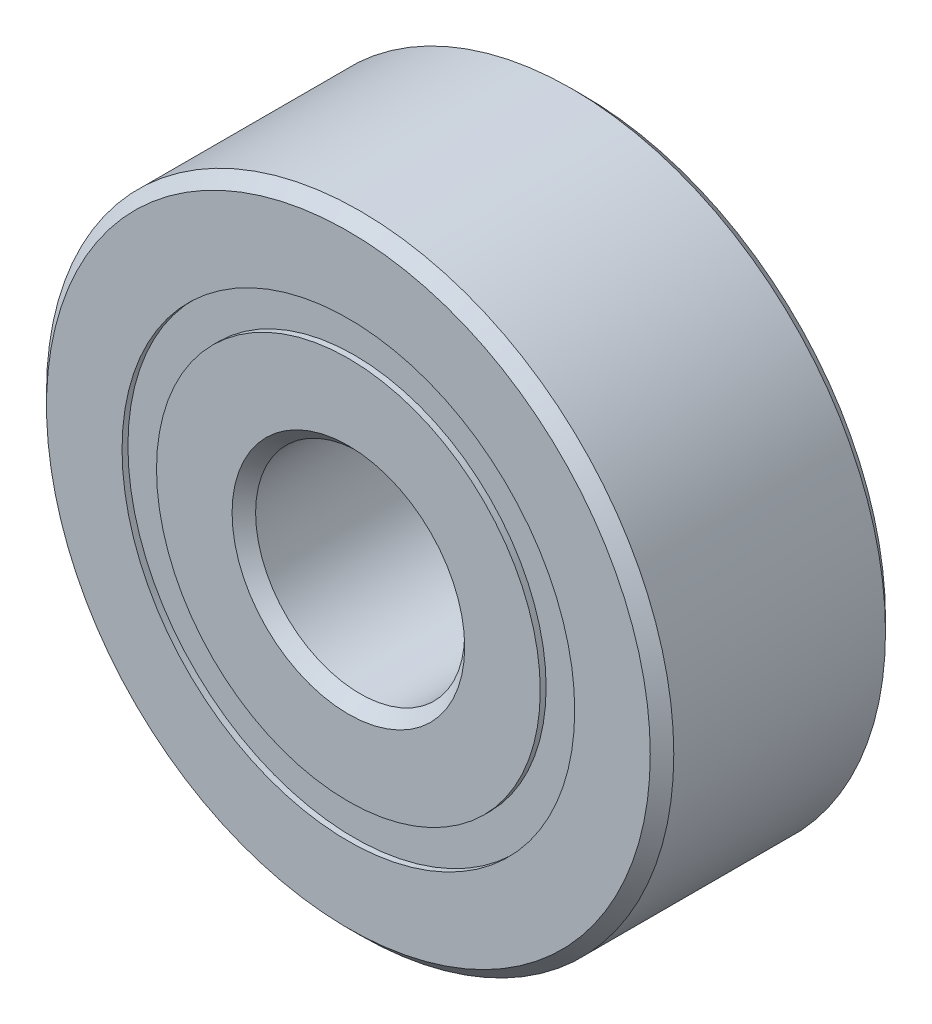
ISO-10303-21;
HEADER;
FILE_DESCRIPTION(('STEP AP214'),'2;1');
FILE_NAME('part.step','',(''),(''),'','','');
FILE_SCHEMA(('AUTOMOTIVE_DESIGN { 1 0 10303 214 1 1 1 1 }'));
ENDSEC;
DATA;
#1=APPLICATION_CONTEXT('core data for automotive mechanical design processes');
#2=APPLICATION_PROTOCOL_DEFINITION('international standard','automotive_design',2000,#1);
#3=PRODUCT_CONTEXT('',#1,'mechanical');
#4=PRODUCT('Part','Part','',(#3));
#5=PRODUCT_RELATED_PRODUCT_CATEGORY('part','',(#4));
#6=PRODUCT_DEFINITION_FORMATION('','',#4);
#7=PRODUCT_DEFINITION_CONTEXT('part definition',#1,'design');
#8=PRODUCT_DEFINITION('design','',#6,#7);
#9=PRODUCT_DEFINITION_SHAPE('','',#8);
#10=(LENGTH_UNIT() NAMED_UNIT(*) SI_UNIT(.MILLI.,.METRE.));
#11=(NAMED_UNIT(*) PLANE_ANGLE_UNIT() SI_UNIT($,.RADIAN.));
#12=(NAMED_UNIT(*) SI_UNIT($,.STERADIAN.) SOLID_ANGLE_UNIT());
#13=UNCERTAINTY_MEASURE_WITH_UNIT(LENGTH_MEASURE(1.E-05),#10,'distance_accuracy_value','');
#14=(GEOMETRIC_REPRESENTATION_CONTEXT(3) GLOBAL_UNCERTAINTY_ASSIGNED_CONTEXT((#13)) GLOBAL_UNIT_ASSIGNED_CONTEXT((#10,
#11,#12)) REPRESENTATION_CONTEXT('',''));
#15=CARTESIAN_POINT('',(0.,0.,0.));
#16=DIRECTION('',(0.,0.,1.));
#17=DIRECTION('',(1.,0.,0.));
#18=AXIS2_PLACEMENT_3D('',#15,#16,#17);
#19=CARTESIAN_POINT('',(0.,6.87335164835165,-3.39328125));
#20=DIRECTION('',(0.,0.,1.));
#21=DIRECTION('',(1.,0.,0.));
#22=AXIS2_PLACEMENT_3D('',#19,#20,#21);
#23=PLANE('',#22);
#24=CARTESIAN_POINT('',(0.,0.,-3.39328125));
#25=DIRECTION('',(0.,0.,1.));
#26=DIRECTION('',(1.,0.,0.));
#27=AXIS2_PLACEMENT_3D('',#24,#25,#26);
#28=CIRCLE('',#27,6.87335164835165);
#29=CARTESIAN_POINT('',(6.87335164835165,0.,-3.39328125));
#30=VERTEX_POINT('',#29);
#31=EDGE_CURVE('E55',#30,#30,#28,.T.);
#32=ORIENTED_EDGE('',*,*,#31,.F.);
#33=EDGE_LOOP('',(#32));
#34=FACE_BOUND('',#33,.T.);
#35=CARTESIAN_POINT('',(0.,0.,-3.39328125));
#36=DIRECTION('',(0.,0.,1.));
#37=DIRECTION('',(1.,0.,0.));
#38=AXIS2_PLACEMENT_3D('',#35,#36,#37);
#39=CIRCLE('',#38,5.82664835164835);
#40=CARTESIAN_POINT('',(5.82664835164835,0.,-3.39328125));
#41=VERTEX_POINT('',#40);
#42=EDGE_CURVE('E11',#41,#41,#39,.T.);
#43=ORIENTED_EDGE('',*,*,#42,.T.);
#44=EDGE_LOOP('',(#43));
#45=FACE_BOUND('',#44,.T.);
#46=ADVANCED_FACE('F41',(#34,#45),#23,.F.);
#47=CARTESIAN_POINT('',(0.,0.,3.571875));
#48=DIRECTION('',(0.,0.,1.));
#49=DIRECTION('',(1.,0.,0.));
#50=AXIS2_PLACEMENT_3D('',#47,#48,#49);
#51=CYLINDRICAL_SURFACE('',#50,5.82664835164835);
#52=ORIENTED_EDGE('',*,*,#42,.F.);
#53=EDGE_LOOP('',(#52));
#54=FACE_BOUND('',#53,.T.);
#55=CARTESIAN_POINT('',(0.,0.,-1.67154216154795));
#56=DIRECTION('',(0.,0.,1.));
#57=DIRECTION('',(1.,0.,0.));
#58=AXIS2_PLACEMENT_3D('',#55,#56,#57);
#59=CIRCLE('',#58,5.82664835164836);
#60=CARTESIAN_POINT('',(5.82664835164836,0.,-1.67154216154795));
#61=VERTEX_POINT('',#60);
#62=EDGE_CURVE('E47',#61,#61,#59,.T.);
#63=ORIENTED_EDGE('',*,*,#62,.T.);
#64=EDGE_LOOP('',(#63));
#65=FACE_BOUND('',#64,.T.);
#66=ADVANCED_FACE('F64',(#54,#65),#51,.F.);
#67=CARTESIAN_POINT('',(0.,6.87335164835165,-1.67154216154795));
#68=DIRECTION('',(0.,0.,-1.));
#69=DIRECTION('',(-1.,0.,0.));
#70=AXIS2_PLACEMENT_3D('',#67,#68,#69);
#71=PLANE('',#70);
#72=ORIENTED_EDGE('',*,*,#62,.F.);
#73=EDGE_LOOP('',(#72));
#74=FACE_BOUND('',#73,.T.);
#75=CARTESIAN_POINT('',(0.,0.,-1.67154216154795));
#76=DIRECTION('',(0.,0.,1.));
#77=DIRECTION('',(1.,0.,0.));
#78=AXIS2_PLACEMENT_3D('',#75,#76,#77);
#79=CIRCLE('',#78,6.87335164835165);
#80=CARTESIAN_POINT('',(6.87335164835165,0.,-1.67154216154795));
#81=VERTEX_POINT('',#80);
#82=EDGE_CURVE('E51',#81,#81,#79,.T.);
#83=ORIENTED_EDGE('',*,*,#82,.T.);
#84=EDGE_LOOP('',(#83));
#85=FACE_BOUND('',#84,.T.);
#86=ADVANCED_FACE('F68',(#74,#85),#71,.F.);
#87=CARTESIAN_POINT('',(0.,0.,3.571875));
#88=DIRECTION('',(0.,0.,1.));
#89=DIRECTION('',(1.,0.,0.));
#90=AXIS2_PLACEMENT_3D('',#87,#88,#89);
#91=CYLINDRICAL_SURFACE('',#90,6.87335164835165);
#92=ORIENTED_EDGE('',*,*,#82,.F.);
#93=EDGE_LOOP('',(#92));
#94=FACE_BOUND('',#93,.T.);
#95=ORIENTED_EDGE('',*,*,#31,.T.);
#96=EDGE_LOOP('',(#95));
#97=FACE_BOUND('',#96,.T.);
#98=ADVANCED_FACE('F61',(#94,#97),#91,.T.);
#99=CLOSED_SHELL('',(#46,#66,#86,#98));
#100=MANIFOLD_SOLID_BREP('B2',#99);
#101=CARTESIAN_POINT('',(0.,6.87335164835165,3.39328125));
#102=DIRECTION('',(0.,0.,-1.));
#103=DIRECTION('',(-1.,0.,0.));
#104=AXIS2_PLACEMENT_3D('',#101,#102,#103);
#105=PLANE('',#104);
#106=CARTESIAN_POINT('',(0.,0.,3.39328125));
#107=DIRECTION('',(0.,0.,1.));
#108=DIRECTION('',(1.,0.,0.));
#109=AXIS2_PLACEMENT_3D('',#106,#107,#108);
#110=CIRCLE('',#109,5.82664835164836);
#111=CARTESIAN_POINT('',(5.82664835164836,0.,3.39328125));
#112=VERTEX_POINT('',#111);
#113=EDGE_CURVE('E40',#112,#112,#110,.T.);
#114=ORIENTED_EDGE('',*,*,#113,.F.);
#115=EDGE_LOOP('',(#114));
#116=FACE_BOUND('',#115,.T.);
#117=CARTESIAN_POINT('',(0.,0.,3.39328125));
#118=DIRECTION('',(0.,0.,1.));
#119=DIRECTION('',(1.,0.,0.));
#120=AXIS2_PLACEMENT_3D('',#117,#118,#119);
#121=CIRCLE('',#120,6.87335164835165);
#122=CARTESIAN_POINT('',(6.87335164835165,0.,3.39328125));
#123=VERTEX_POINT('',#122);
#124=EDGE_CURVE('E122',#123,#123,#121,.T.);
#125=ORIENTED_EDGE('',*,*,#124,.T.);
#126=EDGE_LOOP('',(#125));
#127=FACE_BOUND('',#126,.T.);
#128=ADVANCED_FACE('F108',(#116,#127),#105,.F.);
#129=CARTESIAN_POINT('',(0.,0.,3.571875));
#130=DIRECTION('',(0.,0.,1.));
#131=DIRECTION('',(1.,0.,0.));
#132=AXIS2_PLACEMENT_3D('',#129,#130,#131);
#133=CYLINDRICAL_SURFACE('',#132,5.82664835164836);
#134=CARTESIAN_POINT('',(0.,0.,1.67154216154795));
#135=DIRECTION('',(0.,0.,1.));
#136=DIRECTION('',(1.,0.,0.));
#137=AXIS2_PLACEMENT_3D('',#134,#135,#136);
#138=CIRCLE('',#137,5.82664835164836);
#139=CARTESIAN_POINT('',(5.82664835164836,0.,1.67154216154795));
#140=VERTEX_POINT('',#139);
#141=EDGE_CURVE('E114',#140,#140,#138,.T.);
#142=ORIENTED_EDGE('',*,*,#141,.F.);
#143=EDGE_LOOP('',(#142));
#144=FACE_BOUND('',#143,.T.);
#145=ORIENTED_EDGE('',*,*,#113,.T.);
#146=EDGE_LOOP('',(#145));
#147=FACE_BOUND('',#146,.T.);
#148=ADVANCED_FACE('F137',(#144,#147),#133,.F.);
#149=CARTESIAN_POINT('',(0.,6.87335164835165,1.67154216154795));
#150=DIRECTION('',(0.,0.,1.));
#151=DIRECTION('',(1.,0.,0.));
#152=AXIS2_PLACEMENT_3D('',#149,#150,#151);
#153=PLANE('',#152);
#154=CARTESIAN_POINT('',(0.,0.,1.67154216154795));
#155=DIRECTION('',(0.,0.,1.));
#156=DIRECTION('',(1.,0.,0.));
#157=AXIS2_PLACEMENT_3D('',#154,#155,#156);
#158=CIRCLE('',#157,6.87335164835165);
#159=CARTESIAN_POINT('',(6.87335164835165,0.,1.67154216154795));
#160=VERTEX_POINT('',#159);
#161=EDGE_CURVE('E118',#160,#160,#158,.T.);
#162=ORIENTED_EDGE('',*,*,#161,.F.);
#163=EDGE_LOOP('',(#162));
#164=FACE_BOUND('',#163,.T.);
#165=ORIENTED_EDGE('',*,*,#141,.T.);
#166=EDGE_LOOP('',(#165));
#167=FACE_BOUND('',#166,.T.);
#168=ADVANCED_FACE('F132',(#164,#167),#153,.F.);
#169=CARTESIAN_POINT('',(0.,0.,3.571875));
#170=DIRECTION('',(0.,0.,1.));
#171=DIRECTION('',(1.,0.,0.));
#172=AXIS2_PLACEMENT_3D('',#169,#170,#171);
#173=CYLINDRICAL_SURFACE('',#172,6.87335164835165);
#174=ORIENTED_EDGE('',*,*,#124,.F.);
#175=EDGE_LOOP('',(#174));
#176=FACE_BOUND('',#175,.T.);
#177=ORIENTED_EDGE('',*,*,#161,.T.);
#178=EDGE_LOOP('',(#177));
#179=FACE_BOUND('',#178,.T.);
#180=ADVANCED_FACE('F129',(#176,#179),#173,.T.);
#181=CLOSED_SHELL('',(#128,#148,#168,#180));
#182=MANIFOLD_SOLID_BREP('B6',#181);
#183=CARTESIAN_POINT('',(-3.73243635205714,5.13725791428096,0.));
#184=DIRECTION('',(0.,0.,1.));
#185=DIRECTION('',(-0.587785252292462,0.809016994374955,0.));
#186=AXIS2_PLACEMENT_3D('',#183,#184,#185);
#187=SPHERICAL_SURFACE('',#186,1.67154216154795);
#188=CARTESIAN_POINT('',(-3.73243635205714,5.13725791428096,1.67154216154795));
#189=VERTEX_POINT('',#188);
#190=VERTEX_LOOP('',#189);
#191=FACE_BOUND('',#190,.T.);
#192=ADVANCED_FACE('F175',(#191),#187,.T.);
#193=CLOSED_SHELL('',(#192));
#194=MANIFOLD_SOLID_BREP('B35',#193);
#195=CARTESIAN_POINT('',(-6.0392088784742,1.96225791428098,0.));
#196=DIRECTION('',(0.,0.,1.));
#197=DIRECTION('',(-0.95105651629515,0.309016994374958,0.));
#198=AXIS2_PLACEMENT_3D('',#195,#196,#197);
#199=SPHERICAL_SURFACE('',#198,1.67154216154795);
#200=CARTESIAN_POINT('',(-6.0392088784742,1.96225791428098,1.67154216154795));
#201=VERTEX_POINT('',#200);
#202=VERTEX_LOOP('',#201);
#203=FACE_BOUND('',#202,.T.);
#204=ADVANCED_FACE('F195',(#203),#199,.T.);
#205=CLOSED_SHELL('',(#204));
#206=MANIFOLD_SOLID_BREP('B104',#205);
#207=CARTESIAN_POINT('',(-6.03920887847424,-1.96225791428086,0.));
#208=DIRECTION('',(0.,0.,1.));
#209=DIRECTION('',(-0.951056516295157,-0.309016994374938,0.));
#210=AXIS2_PLACEMENT_3D('',#207,#208,#209);
#211=SPHERICAL_SURFACE('',#210,1.67154216154795);
#212=CARTESIAN_POINT('',(-6.03920887847424,-1.96225791428086,1.67154216154795));
#213=VERTEX_POINT('',#212);
#214=VERTEX_LOOP('',#213);
#215=FACE_BOUND('',#214,.T.);
#216=ADVANCED_FACE('F215',(#215),#211,.T.);
#217=CLOSED_SHELL('',(#216));
#218=MANIFOLD_SOLID_BREP('B171',#217);
#219=CARTESIAN_POINT('',(-3.73243635205725,-5.13725791428088,0.));
#220=DIRECTION('',(0.,0.,1.));
#221=DIRECTION('',(-0.58778525229248,-0.809016994374942,0.));
#222=AXIS2_PLACEMENT_3D('',#219,#220,#221);
#223=SPHERICAL_SURFACE('',#222,1.67154216154795);
#224=CARTESIAN_POINT('',(-3.73243635205725,-5.13725791428088,1.67154216154795));
#225=VERTEX_POINT('',#224);
#226=VERTEX_LOOP('',#225);
#227=FACE_BOUND('',#226,.T.);
#228=ADVANCED_FACE('F235',(#227),#223,.T.);
#229=CLOSED_SHELL('',(#228));
#230=MANIFOLD_SOLID_BREP('B191',#229);
#231=CARTESIAN_POINT('',(0.,-6.35,0.));
#232=DIRECTION('',(0.,0.,1.));
#233=DIRECTION('',(0.,-1.,0.));
#234=AXIS2_PLACEMENT_3D('',#231,#232,#233);
#235=SPHERICAL_SURFACE('',#234,1.67154216154795);
#236=CARTESIAN_POINT('',(0.,-6.35,1.67154216154795));
#237=VERTEX_POINT('',#236);
#238=VERTEX_LOOP('',#237);
#239=FACE_BOUND('',#238,.T.);
#240=ADVANCED_FACE('F255',(#239),#235,.T.);
#241=CLOSED_SHELL('',(#240));
#242=MANIFOLD_SOLID_BREP('B211',#241);
#243=CARTESIAN_POINT('',(3.73243635205718,-5.13725791428094,0.));
#244=DIRECTION('',(0.,0.,1.));
#245=DIRECTION('',(0.587785252292469,-0.809016994374951,0.));
#246=AXIS2_PLACEMENT_3D('',#243,#244,#245);
#247=SPHERICAL_SURFACE('',#246,1.67154216154795);
#248=CARTESIAN_POINT('',(3.73243635205718,-5.13725791428094,1.67154216154795));
#249=VERTEX_POINT('',#248);
#250=VERTEX_LOOP('',#249);
#251=FACE_BOUND('',#250,.T.);
#252=ADVANCED_FACE('F275',(#251),#247,.T.);
#253=CLOSED_SHELL('',(#252));
#254=MANIFOLD_SOLID_BREP('B231',#253);
#255=CARTESIAN_POINT('',(6.03920887847422,-1.96225791428094,0.));
#256=DIRECTION('',(0.,0.,1.));
#257=DIRECTION('',(0.951056516295152,-0.309016994374952,0.));
#258=AXIS2_PLACEMENT_3D('',#255,#256,#257);
#259=SPHERICAL_SURFACE('',#258,1.67154216154795);
#260=CARTESIAN_POINT('',(6.03920887847422,-1.96225791428094,1.67154216154795));
#261=VERTEX_POINT('',#260);
#262=VERTEX_LOOP('',#261);
#263=FACE_BOUND('',#262,.T.);
#264=ADVANCED_FACE('F295',(#263),#259,.T.);
#265=CLOSED_SHELL('',(#264));
#266=MANIFOLD_SOLID_BREP('B251',#265);
#267=CARTESIAN_POINT('',(6.03920887847423,1.9622579142809,0.));
#268=DIRECTION('',(0.,0.,1.));
#269=DIRECTION('',(0.951056516295155,0.309016994374945,0.));
#270=AXIS2_PLACEMENT_3D('',#267,#268,#269);
#271=SPHERICAL_SURFACE('',#270,1.67154216154795);
#272=CARTESIAN_POINT('',(6.03920887847423,1.9622579142809,1.67154216154795));
#273=VERTEX_POINT('',#272);
#274=VERTEX_LOOP('',#273);
#275=FACE_BOUND('',#274,.T.);
#276=ADVANCED_FACE('F315',(#275),#271,.T.);
#277=CLOSED_SHELL('',(#276));
#278=MANIFOLD_SOLID_BREP('B271',#277);
#279=CARTESIAN_POINT('',(3.73243635205721,5.13725791428091,0.));
#280=DIRECTION('',(0.,0.,1.));
#281=DIRECTION('',(0.587785252292474,0.809016994374947,0.));
#282=AXIS2_PLACEMENT_3D('',#279,#280,#281);
#283=SPHERICAL_SURFACE('',#282,1.67154216154795);
#284=CARTESIAN_POINT('',(3.73243635205721,5.13725791428091,1.67154216154795));
#285=VERTEX_POINT('',#284);
#286=VERTEX_LOOP('',#285);
#287=FACE_BOUND('',#286,.T.);
#288=ADVANCED_FACE('F335',(#287),#283,.T.);
#289=CLOSED_SHELL('',(#288));
#290=MANIFOLD_SOLID_BREP('B291',#289);
#291=CARTESIAN_POINT('',(0.,6.35,0.));
#292=DIRECTION('',(0.,0.,1.));
#293=DIRECTION('',(0.,1.,0.));
#294=AXIS2_PLACEMENT_3D('',#291,#292,#293);
#295=SPHERICAL_SURFACE('',#294,1.67154216154795);
#296=CARTESIAN_POINT('',(0.,6.35,1.67154216154795));
#297=VERTEX_POINT('',#296);
#298=VERTEX_LOOP('',#297);
#299=FACE_BOUND('',#298,.T.);
#300=ADVANCED_FACE('F357',(#299),#295,.T.);
#301=CLOSED_SHELL('',(#300));
#302=MANIFOLD_SOLID_BREP('B311',#301);
#303=CARTESIAN_POINT('',(0.,5.82664835164836,3.571875));
#304=DIRECTION('',(0.,0.,-1.));
#305=DIRECTION('',(-1.,0.,0.));
#306=AXIS2_PLACEMENT_3D('',#303,#304,#305);
#307=PLANE('',#306);
#308=CARTESIAN_POINT('',(0.,0.,3.571875));
#309=DIRECTION('',(0.,0.,1.));
#310=DIRECTION('',(1.,0.,0.));
#311=AXIS2_PLACEMENT_3D('',#308,#309,#310);
#312=CIRCLE('',#311,3.5321875);
#313=CARTESIAN_POINT('',(3.5321875,0.,3.571875));
#314=VERTEX_POINT('',#313);
#315=EDGE_CURVE('E404',#314,#314,#312,.T.);
#316=ORIENTED_EDGE('',*,*,#315,.F.);
#317=EDGE_LOOP('',(#316));
#318=FACE_BOUND('',#317,.T.);
#319=CARTESIAN_POINT('',(0.,0.,3.571875));
#320=DIRECTION('',(0.,0.,1.));
#321=DIRECTION('',(1.,0.,0.));
#322=AXIS2_PLACEMENT_3D('',#319,#320,#321);
#323=CIRCLE('',#322,5.82664835164836);
#324=CARTESIAN_POINT('',(5.82664835164836,0.,3.571875));
#325=VERTEX_POINT('',#324);
#326=EDGE_CURVE('E356',#325,#325,#323,.T.);
#327=ORIENTED_EDGE('',*,*,#326,.T.);
#328=EDGE_LOOP('',(#327));
#329=FACE_BOUND('',#328,.T.);
#330=ADVANCED_FACE('F376',(#318,#329),#307,.F.);
#331=CARTESIAN_POINT('',(0.,0.,3.571875));
#332=DIRECTION('',(0.,0.,1.));
#333=DIRECTION('',(1.,0.,0.));
#334=AXIS2_PLACEMENT_3D('',#331,#332,#333);
#335=CYLINDRICAL_SURFACE('',#334,5.82664835164836);
#336=ORIENTED_EDGE('',*,*,#326,.F.);
#337=EDGE_LOOP('',(#336));
#338=FACE_BOUND('',#337,.T.);
#339=CARTESIAN_POINT('',(0.,0.,1.5875));
#340=DIRECTION('',(0.,0.,1.));
#341=DIRECTION('',(1.,0.,0.));
#342=AXIS2_PLACEMENT_3D('',#339,#340,#341);
#343=CIRCLE('',#342,5.82664835164836);
#344=CARTESIAN_POINT('',(5.82664835164836,0.,1.5875));
#345=VERTEX_POINT('',#344);
#346=EDGE_CURVE('E382',#345,#345,#343,.T.);
#347=ORIENTED_EDGE('',*,*,#346,.T.);
#348=EDGE_LOOP('',(#347));
#349=FACE_BOUND('',#348,.T.);
#350=ADVANCED_FACE('F411',(#338,#349),#335,.T.);
#351=CARTESIAN_POINT('',(0.,0.,0.));
#352=DIRECTION('',(0.,0.,1.));
#353=DIRECTION('',(1.,0.,0.));
#354=AXIS2_PLACEMENT_3D('',#351,#352,#353);
#355=TOROIDAL_SURFACE('',#354,6.35,1.67154216154795);
#356=ORIENTED_EDGE('',*,*,#346,.F.);
#357=EDGE_LOOP('',(#356));
#358=FACE_BOUND('',#357,.T.);
#359=CARTESIAN_POINT('',(0.,0.,-1.5875));
#360=DIRECTION('',(0.,0.,1.));
#361=DIRECTION('',(1.,0.,0.));
#362=AXIS2_PLACEMENT_3D('',#359,#360,#361);
#363=CIRCLE('',#362,5.82664835164836);
#364=CARTESIAN_POINT('',(5.82664835164836,0.,-1.5875));
#365=VERTEX_POINT('',#364);
#366=EDGE_CURVE('E386',#365,#365,#363,.T.);
#367=ORIENTED_EDGE('',*,*,#366,.T.);
#368=EDGE_LOOP('',(#367));
#369=FACE_BOUND('',#368,.T.);
#370=ADVANCED_FACE('F415',(#358,#369),#355,.F.);
#371=CARTESIAN_POINT('',(0.,0.,3.571875));
#372=DIRECTION('',(0.,0.,1.));
#373=DIRECTION('',(1.,0.,0.));
#374=AXIS2_PLACEMENT_3D('',#371,#372,#373);
#375=CYLINDRICAL_SURFACE('',#374,5.82664835164836);
#376=ORIENTED_EDGE('',*,*,#366,.F.);
#377=EDGE_LOOP('',(#376));
#378=FACE_BOUND('',#377,.T.);
#379=CARTESIAN_POINT('',(0.,0.,-3.571875));
#380=DIRECTION('',(0.,0.,1.));
#381=DIRECTION('',(1.,0.,0.));
#382=AXIS2_PLACEMENT_3D('',#379,#380,#381);
#383=CIRCLE('',#382,5.82664835164836);
#384=CARTESIAN_POINT('',(5.82664835164836,0.,-3.571875));
#385=VERTEX_POINT('',#384);
#386=EDGE_CURVE('E390',#385,#385,#383,.T.);
#387=ORIENTED_EDGE('',*,*,#386,.T.);
#388=EDGE_LOOP('',(#387));
#389=FACE_BOUND('',#388,.T.);
#390=ADVANCED_FACE('F420',(#378,#389),#375,.T.);
#391=CARTESIAN_POINT('',(0.,3.5321875,-3.571875));
#392=DIRECTION('',(0.,0.,1.));
#393=DIRECTION('',(1.,0.,0.));
#394=AXIS2_PLACEMENT_3D('',#391,#392,#393);
#395=PLANE('',#394);
#396=ORIENTED_EDGE('',*,*,#386,.F.);
#397=EDGE_LOOP('',(#396));
#398=FACE_BOUND('',#397,.T.);
#399=CARTESIAN_POINT('',(0.,0.,-3.571875));
#400=DIRECTION('',(0.,0.,1.));
#401=DIRECTION('',(1.,0.,0.));
#402=AXIS2_PLACEMENT_3D('',#399,#400,#401);
#403=CIRCLE('',#402,3.5321875);
#404=CARTESIAN_POINT('',(3.5321875,0.,-3.571875));
#405=VERTEX_POINT('',#404);
#406=EDGE_CURVE('E395',#405,#405,#403,.T.);
#407=ORIENTED_EDGE('',*,*,#406,.T.);
#408=EDGE_LOOP('',(#407));
#409=FACE_BOUND('',#408,.T.);
#410=ADVANCED_FACE('F426',(#398,#409),#395,.F.);
#411=CARTESIAN_POINT('',(0.,0.,-3.2146875));
#412=DIRECTION('',(0.,0.,-1.));
#413=DIRECTION('',(-1.,0.,0.));
#414=AXIS2_PLACEMENT_3D('',#411,#412,#413);
#415=CONICAL_SURFACE('',#414,3.175,0.78539816339744);
#416=ORIENTED_EDGE('',*,*,#406,.F.);
#417=EDGE_LOOP('',(#416));
#418=FACE_BOUND('',#417,.T.);
#419=CARTESIAN_POINT('',(0.,0.,-3.2146875));
#420=DIRECTION('',(0.,0.,1.));
#421=DIRECTION('',(1.,0.,0.));
#422=AXIS2_PLACEMENT_3D('',#419,#420,#421);
#423=CIRCLE('',#422,3.175);
#424=CARTESIAN_POINT('',(3.175,0.,-3.2146875));
#425=VERTEX_POINT('',#424);
#426=EDGE_CURVE('E398',#425,#425,#423,.T.);
#427=ORIENTED_EDGE('',*,*,#426,.T.);
#428=EDGE_LOOP('',(#427));
#429=FACE_BOUND('',#428,.T.);
#430=ADVANCED_FACE('F430',(#418,#429),#415,.F.);
#431=CARTESIAN_POINT('',(0.,0.,3.571875));
#432=DIRECTION('',(0.,0.,1.));
#433=DIRECTION('',(1.,0.,0.));
#434=AXIS2_PLACEMENT_3D('',#431,#432,#433);
#435=CYLINDRICAL_SURFACE('',#434,3.175);
#436=ORIENTED_EDGE('',*,*,#426,.F.);
#437=EDGE_LOOP('',(#436));
#438=FACE_BOUND('',#437,.T.);
#439=CARTESIAN_POINT('',(0.,0.,3.21468750000001));
#440=DIRECTION('',(0.,0.,1.));
#441=DIRECTION('',(1.,0.,0.));
#442=AXIS2_PLACEMENT_3D('',#439,#440,#441);
#443=CIRCLE('',#442,3.175);
#444=CARTESIAN_POINT('',(3.175,0.,3.21468750000001));
#445=VERTEX_POINT('',#444);
#446=EDGE_CURVE('E401',#445,#445,#443,.T.);
#447=ORIENTED_EDGE('',*,*,#446,.T.);
#448=EDGE_LOOP('',(#447));
#449=FACE_BOUND('',#448,.T.);
#450=ADVANCED_FACE('F434',(#438,#449),#435,.F.);
#451=CARTESIAN_POINT('',(0.,0.,3.571875));
#452=DIRECTION('',(0.,0.,1.));
#453=DIRECTION('',(1.,0.,0.));
#454=AXIS2_PLACEMENT_3D('',#451,#452,#453);
#455=CONICAL_SURFACE('',#454,3.5321875,0.785398163397458);
#456=ORIENTED_EDGE('',*,*,#446,.F.);
#457=EDGE_LOOP('',(#456));
#458=FACE_BOUND('',#457,.T.);
#459=ORIENTED_EDGE('',*,*,#315,.T.);
#460=EDGE_LOOP('',(#459));
#461=FACE_BOUND('',#460,.T.);
#462=ADVANCED_FACE('F408',(#458,#461),#455,.F.);
#463=CLOSED_SHELL('',(#330,#350,#370,#390,#410,#430,#450,#462));
#464=MANIFOLD_SOLID_BREP('B331',#463);
#465=CARTESIAN_POINT('',(0.,0.,3.2146875));
#466=DIRECTION('',(0.,0.,-1.));
#467=DIRECTION('',(-1.,0.,0.));
#468=AXIS2_PLACEMENT_3D('',#465,#466,#467);
#469=CONICAL_SURFACE('',#468,9.525,0.785398163397446);
#470=CARTESIAN_POINT('',(0.,0.,3.571875));
#471=DIRECTION('',(0.,0.,1.));
#472=DIRECTION('',(1.,0.,0.));
#473=AXIS2_PLACEMENT_3D('',#470,#471,#472);
#474=CIRCLE('',#473,9.1678125);
#475=CARTESIAN_POINT('',(9.1678125,0.,3.571875));
#476=VERTEX_POINT('',#475);
#477=EDGE_CURVE('E525',#476,#476,#474,.T.);
#478=ORIENTED_EDGE('',*,*,#477,.F.);
#479=EDGE_LOOP('',(#478));
#480=FACE_BOUND('',#479,.T.);
#481=CARTESIAN_POINT('',(0.,0.,3.2146875));
#482=DIRECTION('',(0.,0.,1.));
#483=DIRECTION('',(1.,0.,0.));
#484=AXIS2_PLACEMENT_3D('',#481,#482,#483);
#485=CIRCLE('',#484,9.525);
#486=CARTESIAN_POINT('',(9.525,0.,3.2146875));
#487=VERTEX_POINT('',#486);
#488=EDGE_CURVE('E375',#487,#487,#485,.T.);
#489=ORIENTED_EDGE('',*,*,#488,.T.);
#490=EDGE_LOOP('',(#489));
#491=FACE_BOUND('',#490,.T.);
#492=ADVANCED_FACE('F497',(#480,#491),#469,.T.);
#493=CARTESIAN_POINT('',(0.,0.,3.571875));
#494=DIRECTION('',(0.,0.,1.));
#495=DIRECTION('',(1.,0.,0.));
#496=AXIS2_PLACEMENT_3D('',#493,#494,#495);
#497=CYLINDRICAL_SURFACE('',#496,9.525);
#498=ORIENTED_EDGE('',*,*,#488,.F.);
#499=EDGE_LOOP('',(#498));
#500=FACE_BOUND('',#499,.T.);
#501=CARTESIAN_POINT('',(0.,0.,-3.2146875));
#502=DIRECTION('',(0.,0.,1.));
#503=DIRECTION('',(1.,0.,0.));
#504=AXIS2_PLACEMENT_3D('',#501,#502,#503);
#505=CIRCLE('',#504,9.525);
#506=CARTESIAN_POINT('',(9.525,0.,-3.2146875));
#507=VERTEX_POINT('',#506);
#508=EDGE_CURVE('E503',#507,#507,#505,.T.);
#509=ORIENTED_EDGE('',*,*,#508,.T.);
#510=EDGE_LOOP('',(#509));
#511=FACE_BOUND('',#510,.T.);
#512=ADVANCED_FACE('F532',(#500,#511),#497,.T.);
#513=CARTESIAN_POINT('',(0.,0.,-3.571875));
#514=DIRECTION('',(0.,0.,1.));
#515=DIRECTION('',(1.,0.,0.));
#516=AXIS2_PLACEMENT_3D('',#513,#514,#515);
#517=CONICAL_SURFACE('',#516,9.1678125,0.785398163397441);
#518=ORIENTED_EDGE('',*,*,#508,.F.);
#519=EDGE_LOOP('',(#518));
#520=FACE_BOUND('',#519,.T.);
#521=CARTESIAN_POINT('',(0.,0.,-3.571875));
#522=DIRECTION('',(0.,0.,1.));
#523=DIRECTION('',(1.,0.,0.));
#524=AXIS2_PLACEMENT_3D('',#521,#522,#523);
#525=CIRCLE('',#524,9.1678125);
#526=CARTESIAN_POINT('',(9.1678125,0.,-3.571875));
#527=VERTEX_POINT('',#526);
#528=EDGE_CURVE('E507',#527,#527,#525,.T.);
#529=ORIENTED_EDGE('',*,*,#528,.T.);
#530=EDGE_LOOP('',(#529));
#531=FACE_BOUND('',#530,.T.);
#532=ADVANCED_FACE('F536',(#520,#531),#517,.T.);
#533=CARTESIAN_POINT('',(0.,9.1678125,-3.571875));
#534=DIRECTION('',(0.,0.,1.));
#535=DIRECTION('',(1.,0.,0.));
#536=AXIS2_PLACEMENT_3D('',#533,#534,#535);
#537=PLANE('',#536);
#538=ORIENTED_EDGE('',*,*,#528,.F.);
#539=EDGE_LOOP('',(#538));
#540=FACE_BOUND('',#539,.T.);
#541=CARTESIAN_POINT('',(0.,0.,-3.571875));
#542=DIRECTION('',(0.,0.,1.));
#543=DIRECTION('',(1.,0.,0.));
#544=AXIS2_PLACEMENT_3D('',#541,#542,#543);
#545=CIRCLE('',#544,6.87335164835165);
#546=CARTESIAN_POINT('',(6.87335164835165,0.,-3.571875));
#547=VERTEX_POINT('',#546);
#548=EDGE_CURVE('E511',#547,#547,#545,.T.);
#549=ORIENTED_EDGE('',*,*,#548,.T.);
#550=EDGE_LOOP('',(#549));
#551=FACE_BOUND('',#550,.T.);
#552=ADVANCED_FACE('F541',(#540,#551),#537,.F.);
#553=CARTESIAN_POINT('',(0.,0.,3.571875));
#554=DIRECTION('',(0.,0.,1.));
#555=DIRECTION('',(1.,0.,0.));
#556=AXIS2_PLACEMENT_3D('',#553,#554,#555);
#557=CYLINDRICAL_SURFACE('',#556,6.87335164835165);
#558=ORIENTED_EDGE('',*,*,#548,.F.);
#559=EDGE_LOOP('',(#558));
#560=FACE_BOUND('',#559,.T.);
#561=CARTESIAN_POINT('',(0.,0.,-1.5875));
#562=DIRECTION('',(0.,0.,1.));
#563=DIRECTION('',(1.,0.,0.));
#564=AXIS2_PLACEMENT_3D('',#561,#562,#563);
#565=CIRCLE('',#564,6.87335164835165);
#566=CARTESIAN_POINT('',(6.87335164835165,0.,-1.5875));
#567=VERTEX_POINT('',#566);
#568=EDGE_CURVE('E516',#567,#567,#565,.T.);
#569=ORIENTED_EDGE('',*,*,#568,.T.);
#570=EDGE_LOOP('',(#569));
#571=FACE_BOUND('',#570,.T.);
#572=ADVANCED_FACE('F547',(#560,#571),#557,.F.);
#573=CARTESIAN_POINT('',(0.,0.,0.));
#574=DIRECTION('',(0.,0.,1.));
#575=DIRECTION('',(1.,0.,0.));
#576=AXIS2_PLACEMENT_3D('',#573,#574,#575);
#577=TOROIDAL_SURFACE('',#576,6.35,1.67154216154795);
#578=ORIENTED_EDGE('',*,*,#568,.F.);
#579=EDGE_LOOP('',(#578));
#580=FACE_BOUND('',#579,.T.);
#581=CARTESIAN_POINT('',(0.,0.,1.5875));
#582=DIRECTION('',(0.,0.,1.));
#583=DIRECTION('',(1.,0.,0.));
#584=AXIS2_PLACEMENT_3D('',#581,#582,#583);
#585=CIRCLE('',#584,6.87335164835165);
#586=CARTESIAN_POINT('',(6.87335164835165,0.,1.5875));
#587=VERTEX_POINT('',#586);
#588=EDGE_CURVE('E519',#587,#587,#585,.T.);
#589=ORIENTED_EDGE('',*,*,#588,.T.);
#590=EDGE_LOOP('',(#589));
#591=FACE_BOUND('',#590,.T.);
#592=ADVANCED_FACE('F551',(#580,#591),#577,.F.);
#593=CARTESIAN_POINT('',(0.,0.,3.571875));
#594=DIRECTION('',(0.,0.,1.));
#595=DIRECTION('',(1.,0.,0.));
#596=AXIS2_PLACEMENT_3D('',#593,#594,#595);
#597=CYLINDRICAL_SURFACE('',#596,6.87335164835165);
#598=ORIENTED_EDGE('',*,*,#588,.F.);
#599=EDGE_LOOP('',(#598));
#600=FACE_BOUND('',#599,.T.);
#601=CARTESIAN_POINT('',(0.,0.,3.571875));
#602=DIRECTION('',(0.,0.,1.));
#603=DIRECTION('',(1.,0.,0.));
#604=AXIS2_PLACEMENT_3D('',#601,#602,#603);
#605=CIRCLE('',#604,6.87335164835165);
#606=CARTESIAN_POINT('',(6.87335164835165,0.,3.571875));
#607=VERTEX_POINT('',#606);
#608=EDGE_CURVE('E522',#607,#607,#605,.T.);
#609=ORIENTED_EDGE('',*,*,#608,.T.);
#610=EDGE_LOOP('',(#609));
#611=FACE_BOUND('',#610,.T.);
#612=ADVANCED_FACE('F555',(#600,#611),#597,.F.);
#613=CARTESIAN_POINT('',(0.,9.1678125,3.571875));
#614=DIRECTION('',(0.,0.,-1.));
#615=DIRECTION('',(-1.,0.,0.));
#616=AXIS2_PLACEMENT_3D('',#613,#614,#615);
#617=PLANE('',#616);
#618=ORIENTED_EDGE('',*,*,#608,.F.);
#619=EDGE_LOOP('',(#618));
#620=FACE_BOUND('',#619,.T.);
#621=ORIENTED_EDGE('',*,*,#477,.T.);
#622=EDGE_LOOP('',(#621));
#623=FACE_BOUND('',#622,.T.);
#624=ADVANCED_FACE('F529',(#620,#623),#617,.F.);
#625=CLOSED_SHELL('',(#492,#512,#532,#552,#572,#592,#612,#624));
#626=MANIFOLD_SOLID_BREP('B351',#625);
#627=ADVANCED_BREP_SHAPE_REPRESENTATION('',(#18,#100,#182,#194,#206,#218,#230,#242,#254,#266,
#278,#290,#302,#464,#626),#14);
#628=SHAPE_DEFINITION_REPRESENTATION(#9,#627);
ENDSEC;
END-ISO-10303-21;
